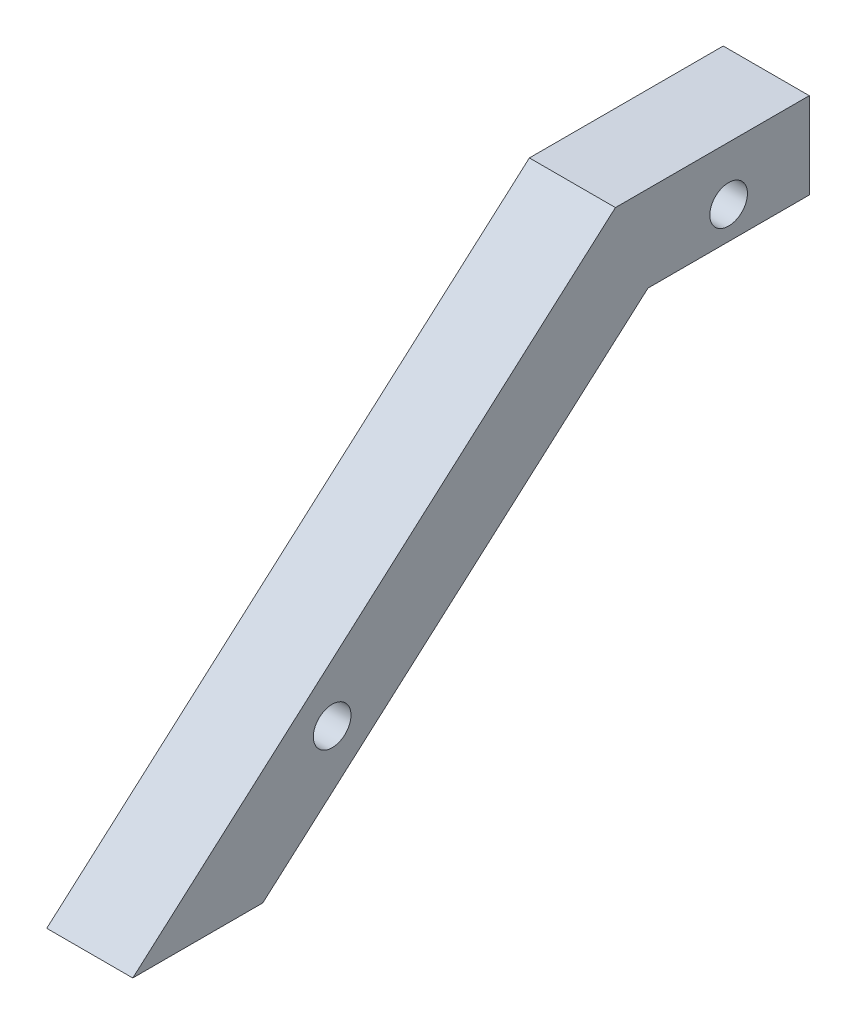
ISO-10303-21;
HEADER;
FILE_DESCRIPTION(('STEP AP214'),'2;1');
FILE_NAME('part.step','',(''),(''),'','','');
FILE_SCHEMA(('AUTOMOTIVE_DESIGN { 1 0 10303 214 1 1 1 1 }'));
ENDSEC;
DATA;
#1=APPLICATION_CONTEXT('core data for automotive mechanical design processes');
#2=APPLICATION_PROTOCOL_DEFINITION('international standard','automotive_design',2000,#1);
#3=PRODUCT_CONTEXT('',#1,'mechanical');
#4=PRODUCT('Part','Part','',(#3));
#5=PRODUCT_RELATED_PRODUCT_CATEGORY('part','',(#4));
#6=PRODUCT_DEFINITION_FORMATION('','',#4);
#7=PRODUCT_DEFINITION_CONTEXT('part definition',#1,'design');
#8=PRODUCT_DEFINITION('design','',#6,#7);
#9=PRODUCT_DEFINITION_SHAPE('','',#8);
#10=(LENGTH_UNIT() NAMED_UNIT(*) SI_UNIT(.MILLI.,.METRE.));
#11=(NAMED_UNIT(*) PLANE_ANGLE_UNIT() SI_UNIT($,.RADIAN.));
#12=(NAMED_UNIT(*) SI_UNIT($,.STERADIAN.) SOLID_ANGLE_UNIT());
#13=UNCERTAINTY_MEASURE_WITH_UNIT(LENGTH_MEASURE(1.E-05),#10,'distance_accuracy_value','');
#14=(GEOMETRIC_REPRESENTATION_CONTEXT(3) GLOBAL_UNCERTAINTY_ASSIGNED_CONTEXT((#13)) GLOBAL_UNIT_ASSIGNED_CONTEXT((#10,
#11,#12)) REPRESENTATION_CONTEXT('',''));
#15=CARTESIAN_POINT('',(0.,0.,0.));
#16=DIRECTION('',(0.,0.,1.));
#17=DIRECTION('',(1.,0.,0.));
#18=AXIS2_PLACEMENT_3D('',#15,#16,#17);
#19=CARTESIAN_POINT('',(-150.5,75.,0.));
#20=DIRECTION('',(0.,1.,0.));
#21=DIRECTION('',(0.,0.,1.));
#22=AXIS2_PLACEMENT_3D('',#19,#20,#21);
#23=PLANE('',#22);
#24=DIRECTION('',(0.,0.,-1.));
#25=VECTOR('',#24,1.);
#26=CARTESIAN_POINT('',(-158.5,75.,0.));
#27=LINE('',#26,#25);
#28=CARTESIAN_POINT('',(-158.5,75.,29.0928109945239));
#29=VERTEX_POINT('',#28);
#30=CARTESIAN_POINT('',(-158.5,75.,14.0928109945239));
#31=VERTEX_POINT('',#30);
#32=EDGE_CURVE('E131',#29,#31,#27,.T.);
#33=ORIENTED_EDGE('',*,*,#32,.T.);
#34=DIRECTION('',(-1.,0.,0.));
#35=VECTOR('',#34,1.);
#36=CARTESIAN_POINT('',(-150.5,75.,14.0928109945239));
#37=LINE('',#36,#35);
#38=CARTESIAN_POINT('',(-150.5,75.,14.0928109945239));
#39=VERTEX_POINT('',#38);
#40=EDGE_CURVE('E11',#39,#31,#37,.T.);
#41=ORIENTED_EDGE('',*,*,#40,.F.);
#42=DIRECTION('',(0.,0.,-1.));
#43=VECTOR('',#42,1.);
#44=CARTESIAN_POINT('',(-150.5,75.,0.));
#45=LINE('',#44,#43);
#46=CARTESIAN_POINT('',(-150.5,75.,29.0928109945239));
#47=VERTEX_POINT('',#46);
#48=EDGE_CURVE('E154',#47,#39,#45,.T.);
#49=ORIENTED_EDGE('',*,*,#48,.F.);
#50=DIRECTION('',(-1.,0.,0.));
#51=VECTOR('',#50,1.);
#52=CARTESIAN_POINT('',(-150.5,75.,29.0928109945239));
#53=LINE('',#52,#51);
#54=EDGE_CURVE('E121',#47,#29,#53,.T.);
#55=ORIENTED_EDGE('',*,*,#54,.T.);
#56=EDGE_LOOP('',(#33,#41,#49,#55));
#57=FACE_BOUND('',#56,.T.);
#58=ADVANCED_FACE('F40',(#57),#23,.F.);
#59=CARTESIAN_POINT('',(-150.5,0.,14.0928109945239));
#60=DIRECTION('',(0.,0.,1.));
#61=DIRECTION('',(1.,0.,0.));
#62=AXIS2_PLACEMENT_3D('',#59,#60,#61);
#63=PLANE('',#62);
#64=DIRECTION('',(0.,1.,0.));
#65=VECTOR('',#64,1.);
#66=CARTESIAN_POINT('',(-158.5,0.,14.0928109945239));
#67=LINE('',#66,#65);
#68=CARTESIAN_POINT('',(-158.5,83.,14.0928109945239));
#69=VERTEX_POINT('',#68);
#70=EDGE_CURVE('E134',#31,#69,#67,.T.);
#71=ORIENTED_EDGE('',*,*,#70,.T.);
#72=DIRECTION('',(-1.,0.,0.));
#73=VECTOR('',#72,1.);
#74=CARTESIAN_POINT('',(-150.5,83.,14.0928109945239));
#75=LINE('',#74,#73);
#76=CARTESIAN_POINT('',(-150.5,83.,14.0928109945239));
#77=VERTEX_POINT('',#76);
#78=EDGE_CURVE('E49',#77,#69,#75,.T.);
#79=ORIENTED_EDGE('',*,*,#78,.F.);
#80=DIRECTION('',(0.,1.,0.));
#81=VECTOR('',#80,1.);
#82=CARTESIAN_POINT('',(-150.5,0.,14.0928109945239));
#83=LINE('',#82,#81);
#84=EDGE_CURVE('E94',#39,#77,#83,.T.);
#85=ORIENTED_EDGE('',*,*,#84,.F.);
#86=ORIENTED_EDGE('',*,*,#40,.T.);
#87=EDGE_LOOP('',(#71,#79,#85,#86));
#88=FACE_BOUND('',#87,.T.);
#89=ADVANCED_FACE('F169',(#88),#63,.F.);
#90=CARTESIAN_POINT('',(-150.5,83.,0.));
#91=DIRECTION('',(0.,-1.,0.));
#92=DIRECTION('',(0.,0.,-1.));
#93=AXIS2_PLACEMENT_3D('',#90,#91,#92);
#94=PLANE('',#93);
#95=DIRECTION('',(0.,0.,1.));
#96=VECTOR('',#95,1.);
#97=CARTESIAN_POINT('',(-158.5,83.,0.));
#98=LINE('',#97,#96);
#99=CARTESIAN_POINT('',(-158.5,83.,32.1176473131956));
#100=VERTEX_POINT('',#99);
#101=EDGE_CURVE('E136',#69,#100,#98,.T.);
#102=ORIENTED_EDGE('',*,*,#101,.T.);
#103=DIRECTION('',(-1.,0.,0.));
#104=VECTOR('',#103,1.);
#105=CARTESIAN_POINT('',(-150.5,83.,32.1176473131956));
#106=LINE('',#105,#104);
#107=CARTESIAN_POINT('',(-150.5,83.,32.1176473131956));
#108=VERTEX_POINT('',#107);
#109=EDGE_CURVE('E116',#108,#100,#106,.T.);
#110=ORIENTED_EDGE('',*,*,#109,.F.);
#111=DIRECTION('',(0.,0.,1.));
#112=VECTOR('',#111,1.);
#113=CARTESIAN_POINT('',(-150.5,83.,0.));
#114=LINE('',#113,#112);
#115=EDGE_CURVE('E107',#77,#108,#114,.T.);
#116=ORIENTED_EDGE('',*,*,#115,.F.);
#117=ORIENTED_EDGE('',*,*,#78,.T.);
#118=EDGE_LOOP('',(#102,#110,#116,#117));
#119=FACE_BOUND('',#118,.T.);
#120=ADVANCED_FACE('F147',(#119),#94,.F.);
#121=CARTESIAN_POINT('',(-150.5,62.6011674413714,55.2363242129747));
#122=DIRECTION('',(0.,-0.749837855365093,-0.661621637086846));
#123=DIRECTION('',(0.,0.661621637086846,-0.749837855365093));
#124=AXIS2_PLACEMENT_3D('',#121,#122,#123);
#125=PLANE('',#124);
#126=DIRECTION('',(0.,-0.661621637086846,0.749837855365093));
#127=VECTOR('',#126,1.);
#128=CARTESIAN_POINT('',(-158.5,62.6011674413714,55.2363242129747));
#129=LINE('',#128,#127);
#130=CARTESIAN_POINT('',(-158.5,43.3979240998785,77.));
#131=VERTEX_POINT('',#130);
#132=EDGE_CURVE('E115',#100,#131,#129,.T.);
#133=ORIENTED_EDGE('',*,*,#132,.T.);
#134=DIRECTION('',(-1.,0.,0.));
#135=VECTOR('',#134,1.);
#136=CARTESIAN_POINT('',(-150.5,43.3979240998785,77.));
#137=LINE('',#136,#135);
#138=CARTESIAN_POINT('',(-150.5,43.3979240998785,77.));
#139=VERTEX_POINT('',#138);
#140=EDGE_CURVE('E112',#139,#131,#137,.T.);
#141=ORIENTED_EDGE('',*,*,#140,.F.);
#142=DIRECTION('',(0.,-0.661621637086846,0.749837855365093));
#143=VECTOR('',#142,1.);
#144=CARTESIAN_POINT('',(-150.5,62.6011674413714,55.2363242129747));
#145=LINE('',#144,#143);
#146=EDGE_CURVE('E101',#108,#139,#145,.T.);
#147=ORIENTED_EDGE('',*,*,#146,.F.);
#148=ORIENTED_EDGE('',*,*,#109,.T.);
#149=EDGE_LOOP('',(#133,#141,#147,#148));
#150=FACE_BOUND('',#149,.T.);
#151=ADVANCED_FACE('F113',(#150),#125,.F.);
#152=CARTESIAN_POINT('',(-150.5,43.3979240998785,0.));
#153=DIRECTION('',(0.,1.,0.));
#154=DIRECTION('',(0.,0.,1.));
#155=AXIS2_PLACEMENT_3D('',#152,#153,#154);
#156=PLANE('',#155);
#157=DIRECTION('',(0.,0.,-1.));
#158=VECTOR('',#157,1.);
#159=CARTESIAN_POINT('',(-158.5,43.3979240998785,0.));
#160=LINE('',#159,#158);
#161=CARTESIAN_POINT('',(-158.5,43.3979240998785,64.9084970146617));
#162=VERTEX_POINT('',#161);
#163=EDGE_CURVE('E80',#131,#162,#160,.T.);
#164=ORIENTED_EDGE('',*,*,#163,.T.);
#165=DIRECTION('',(-1.,0.,0.));
#166=VECTOR('',#165,1.);
#167=CARTESIAN_POINT('',(-150.5,43.3979240998785,64.9084970146617));
#168=LINE('',#167,#166);
#169=CARTESIAN_POINT('',(-150.5,43.3979240998785,64.9084970146617));
#170=VERTEX_POINT('',#169);
#171=EDGE_CURVE('E117',#170,#162,#168,.T.);
#172=ORIENTED_EDGE('',*,*,#171,.F.);
#173=DIRECTION('',(0.,0.,-1.));
#174=VECTOR('',#173,1.);
#175=CARTESIAN_POINT('',(-150.5,43.3979240998785,0.));
#176=LINE('',#175,#174);
#177=EDGE_CURVE('E105',#139,#170,#176,.T.);
#178=ORIENTED_EDGE('',*,*,#177,.F.);
#179=ORIENTED_EDGE('',*,*,#140,.T.);
#180=EDGE_LOOP('',(#164,#172,#178,#179));
#181=FACE_BOUND('',#180,.T.);
#182=ADVANCED_FACE('F119',(#181),#156,.F.);
#183=CARTESIAN_POINT('',(-150.5,54.4229936078831,58.4591697315922));
#184=DIRECTION('',(-1.,0.,0.));
#185=DIRECTION('',(0.,0.,1.));
#186=AXIS2_PLACEMENT_3D('',#183,#184,#185);
#187=CYLINDRICAL_SURFACE('',#186,1.75);
#188=CARTESIAN_POINT('',(-150.5,54.4229936078831,58.4591697315922));
#189=DIRECTION('',(1.,0.,0.));
#190=DIRECTION('',(0.,0.,-1.));
#191=AXIS2_PLACEMENT_3D('',#188,#189,#190);
#192=CIRCLE('',#191,1.75);
#193=CARTESIAN_POINT('',(-150.5,54.4229936078831,56.7091697315922));
#194=VERTEX_POINT('',#193);
#195=EDGE_CURVE('E184',#194,#194,#192,.F.);
#196=ORIENTED_EDGE('',*,*,#195,.F.);
#197=EDGE_LOOP('',(#196));
#198=FACE_BOUND('',#197,.T.);
#199=CARTESIAN_POINT('',(-158.5,54.4229936078831,58.4591697315922));
#200=DIRECTION('',(1.,0.,0.));
#201=DIRECTION('',(0.,0.,-1.));
#202=AXIS2_PLACEMENT_3D('',#199,#200,#201);
#203=CIRCLE('',#202,1.75);
#204=CARTESIAN_POINT('',(-158.5,54.4229936078831,56.7091697315922));
#205=VERTEX_POINT('',#204);
#206=EDGE_CURVE('E128',#205,#205,#203,.F.);
#207=ORIENTED_EDGE('',*,*,#206,.T.);
#208=EDGE_LOOP('',(#207));
#209=FACE_BOUND('',#208,.T.);
#210=ADVANCED_FACE('F164',(#198,#209),#187,.F.);
#211=CARTESIAN_POINT('',(-150.5,78.,21.5928109945239));
#212=DIRECTION('',(-1.,0.,0.));
#213=DIRECTION('',(0.,0.,1.));
#214=AXIS2_PLACEMENT_3D('',#211,#212,#213);
#215=CYLINDRICAL_SURFACE('',#214,1.75);
#216=CARTESIAN_POINT('',(-150.5,78.,21.5928109945239));
#217=DIRECTION('',(1.,0.,0.));
#218=DIRECTION('',(0.,0.,-1.));
#219=AXIS2_PLACEMENT_3D('',#216,#217,#218);
#220=CIRCLE('',#219,1.75);
#221=CARTESIAN_POINT('',(-150.5,78.,19.8428109945239));
#222=VERTEX_POINT('',#221);
#223=EDGE_CURVE('E141',#222,#222,#220,.F.);
#224=ORIENTED_EDGE('',*,*,#223,.F.);
#225=EDGE_LOOP('',(#224));
#226=FACE_BOUND('',#225,.T.);
#227=CARTESIAN_POINT('',(-158.5,78.,21.5928109945239));
#228=DIRECTION('',(1.,0.,0.));
#229=DIRECTION('',(0.,0.,-1.));
#230=AXIS2_PLACEMENT_3D('',#227,#228,#229);
#231=CIRCLE('',#230,1.75);
#232=CARTESIAN_POINT('',(-158.5,78.,19.8428109945239));
#233=VERTEX_POINT('',#232);
#234=EDGE_CURVE('E125',#233,#233,#231,.F.);
#235=ORIENTED_EDGE('',*,*,#234,.T.);
#236=EDGE_LOOP('',(#235));
#237=FACE_BOUND('',#236,.T.);
#238=ADVANCED_FACE('F42',(#226,#237),#215,.F.);
#239=CARTESIAN_POINT('',(-150.5,56.6024645984506,49.9433511162799));
#240=DIRECTION('',(0.,0.749837855365093,0.661621637086846));
#241=DIRECTION('',(0.,-0.661621637086846,0.749837855365093));
#242=AXIS2_PLACEMENT_3D('',#239,#240,#241);
#243=PLANE('',#242);
#244=DIRECTION('',(0.,0.661621637086846,-0.749837855365093));
#245=VECTOR('',#244,1.);
#246=CARTESIAN_POINT('',(-158.5,56.6024645984506,49.9433511162799));
#247=LINE('',#246,#245);
#248=EDGE_CURVE('E86',#162,#29,#247,.T.);
#249=ORIENTED_EDGE('',*,*,#248,.T.);
#250=ORIENTED_EDGE('',*,*,#54,.F.);
#251=DIRECTION('',(0.,0.661621637086846,-0.749837855365093));
#252=VECTOR('',#251,1.);
#253=CARTESIAN_POINT('',(-150.5,56.6024645984506,49.9433511162799));
#254=LINE('',#253,#252);
#255=EDGE_CURVE('E57',#170,#47,#254,.T.);
#256=ORIENTED_EDGE('',*,*,#255,.F.);
#257=ORIENTED_EDGE('',*,*,#171,.T.);
#258=EDGE_LOOP('',(#249,#250,#256,#257));
#259=FACE_BOUND('',#258,.T.);
#260=ADVANCED_FACE('F155',(#259),#243,.F.);
#261=CARTESIAN_POINT('',(-150.5,0.,0.));
#262=DIRECTION('',(1.,0.,0.));
#263=DIRECTION('',(0.,0.,-1.));
#264=AXIS2_PLACEMENT_3D('',#261,#262,#263);
#265=PLANE('',#264);
#266=ORIENTED_EDGE('',*,*,#223,.T.);
#267=EDGE_LOOP('',(#266));
#268=FACE_BOUND('',#267,.T.);
#269=ORIENTED_EDGE('',*,*,#195,.T.);
#270=EDGE_LOOP('',(#269));
#271=FACE_BOUND('',#270,.T.);
#272=ORIENTED_EDGE('',*,*,#48,.T.);
#273=ORIENTED_EDGE('',*,*,#84,.T.);
#274=ORIENTED_EDGE('',*,*,#115,.T.);
#275=ORIENTED_EDGE('',*,*,#146,.T.);
#276=ORIENTED_EDGE('',*,*,#177,.T.);
#277=ORIENTED_EDGE('',*,*,#255,.T.);
#278=EDGE_LOOP('',(#272,#273,#274,#275,#276,#277));
#279=FACE_BOUND('',#278,.T.);
#280=ADVANCED_FACE('F103',(#268,#271,#279),#265,.T.);
#281=CARTESIAN_POINT('',(-158.5,0.,0.));
#282=DIRECTION('',(1.,0.,0.));
#283=DIRECTION('',(0.,0.,-1.));
#284=AXIS2_PLACEMENT_3D('',#281,#282,#283);
#285=PLANE('',#284);
#286=ORIENTED_EDGE('',*,*,#234,.F.);
#287=EDGE_LOOP('',(#286));
#288=FACE_BOUND('',#287,.T.);
#289=ORIENTED_EDGE('',*,*,#206,.F.);
#290=EDGE_LOOP('',(#289));
#291=FACE_BOUND('',#290,.T.);
#292=ORIENTED_EDGE('',*,*,#32,.F.);
#293=ORIENTED_EDGE('',*,*,#248,.F.);
#294=ORIENTED_EDGE('',*,*,#163,.F.);
#295=ORIENTED_EDGE('',*,*,#132,.F.);
#296=ORIENTED_EDGE('',*,*,#101,.F.);
#297=ORIENTED_EDGE('',*,*,#70,.F.);
#298=EDGE_LOOP('',(#292,#293,#294,#295,#296,#297));
#299=FACE_BOUND('',#298,.T.);
#300=ADVANCED_FACE('F150',(#288,#291,#299),#285,.F.);
#301=CLOSED_SHELL('',(#58,#89,#120,#151,#182,#210,#238,#260,#280,#300));
#302=MANIFOLD_SOLID_BREP('B2',#301);
#303=ADVANCED_BREP_SHAPE_REPRESENTATION('',(#18,#302),#14);
#304=SHAPE_DEFINITION_REPRESENTATION(#9,#303);
ENDSEC;
END-ISO-10303-21;
